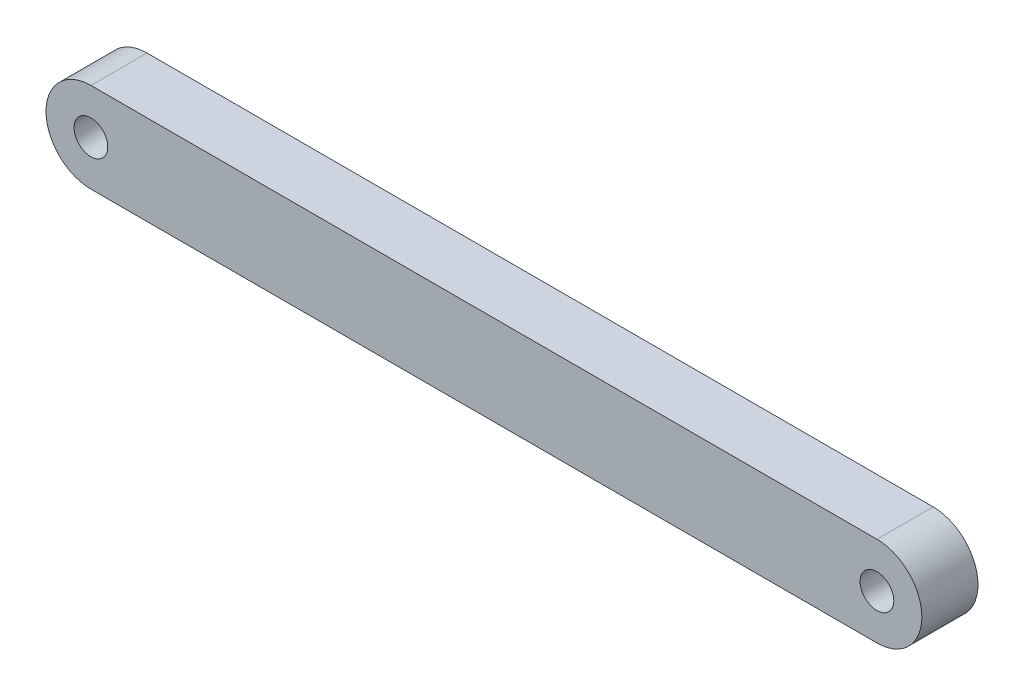
ISO-10303-21;
HEADER;
FILE_DESCRIPTION(('STEP AP214'),'2;1');
FILE_NAME('part.step','',(''),(''),'','','');
FILE_SCHEMA(('AUTOMOTIVE_DESIGN { 1 0 10303 214 1 1 1 1 }'));
ENDSEC;
DATA;
#1=APPLICATION_CONTEXT('core data for automotive mechanical design processes');
#2=APPLICATION_PROTOCOL_DEFINITION('international standard','automotive_design',2000,#1);
#3=PRODUCT_CONTEXT('',#1,'mechanical');
#4=PRODUCT('Part','Part','',(#3));
#5=PRODUCT_RELATED_PRODUCT_CATEGORY('part','',(#4));
#6=PRODUCT_DEFINITION_FORMATION('','',#4);
#7=PRODUCT_DEFINITION_CONTEXT('part definition',#1,'design');
#8=PRODUCT_DEFINITION('design','',#6,#7);
#9=PRODUCT_DEFINITION_SHAPE('','',#8);
#10=(LENGTH_UNIT() NAMED_UNIT(*) SI_UNIT(.MILLI.,.METRE.));
#11=(NAMED_UNIT(*) PLANE_ANGLE_UNIT() SI_UNIT($,.RADIAN.));
#12=(NAMED_UNIT(*) SI_UNIT($,.STERADIAN.) SOLID_ANGLE_UNIT());
#13=UNCERTAINTY_MEASURE_WITH_UNIT(LENGTH_MEASURE(1.E-05),#10,'distance_accuracy_value','');
#14=(GEOMETRIC_REPRESENTATION_CONTEXT(3) GLOBAL_UNCERTAINTY_ASSIGNED_CONTEXT((#13)) GLOBAL_UNIT_ASSIGNED_CONTEXT((#10,
#11,#12)) REPRESENTATION_CONTEXT('',''));
#15=CARTESIAN_POINT('',(0.,0.,0.));
#16=DIRECTION('',(0.,0.,1.));
#17=DIRECTION('',(1.,0.,0.));
#18=AXIS2_PLACEMENT_3D('',#15,#16,#17);
#19=CARTESIAN_POINT('',(0.,0.,5.));
#20=DIRECTION('',(0.,0.,1.));
#21=DIRECTION('',(1.,0.,0.));
#22=AXIS2_PLACEMENT_3D('',#19,#20,#21);
#23=PLANE('',#22);
#24=CARTESIAN_POINT('',(0.,0.,5.));
#25=DIRECTION('',(0.,0.,1.));
#26=DIRECTION('',(1.,0.,0.));
#27=AXIS2_PLACEMENT_3D('',#24,#25,#26);
#28=CIRCLE('',#27,1.5);
#29=CARTESIAN_POINT('',(1.5,0.,5.));
#30=VERTEX_POINT('',#29);
#31=EDGE_CURVE('E112',#30,#30,#28,.T.);
#32=ORIENTED_EDGE('',*,*,#31,.F.);
#33=EDGE_LOOP('',(#32));
#34=FACE_BOUND('',#33,.T.);
#35=CARTESIAN_POINT('',(0.,0.,5.));
#36=DIRECTION('',(0.,0.,1.));
#37=DIRECTION('',(1.,0.,0.));
#38=AXIS2_PLACEMENT_3D('',#35,#36,#37);
#39=CIRCLE('',#38,4.);
#40=CARTESIAN_POINT('',(0.,4.,5.));
#41=VERTEX_POINT('',#40);
#42=CARTESIAN_POINT('',(0.,-4.,5.));
#43=VERTEX_POINT('',#42);
#44=EDGE_CURVE('E92',#41,#43,#39,.T.);
#45=ORIENTED_EDGE('',*,*,#44,.T.);
#46=DIRECTION('',(1.,0.,0.));
#47=VECTOR('',#46,1.);
#48=CARTESIAN_POINT('',(0.,-4.,5.));
#49=LINE('',#48,#47);
#50=CARTESIAN_POINT('',(70.,-4.,5.));
#51=VERTEX_POINT('',#50);
#52=EDGE_CURVE('E87',#43,#51,#49,.T.);
#53=ORIENTED_EDGE('',*,*,#52,.T.);
#54=CARTESIAN_POINT('',(70.,0.,5.));
#55=DIRECTION('',(0.,0.,1.));
#56=DIRECTION('',(1.,0.,0.));
#57=AXIS2_PLACEMENT_3D('',#54,#55,#56);
#58=CIRCLE('',#57,4.);
#59=CARTESIAN_POINT('',(70.,4.,5.));
#60=VERTEX_POINT('',#59);
#61=EDGE_CURVE('E90',#51,#60,#58,.T.);
#62=ORIENTED_EDGE('',*,*,#61,.T.);
#63=DIRECTION('',(-1.,0.,0.));
#64=VECTOR('',#63,1.);
#65=CARTESIAN_POINT('',(0.,4.,5.));
#66=LINE('',#65,#64);
#67=EDGE_CURVE('E57',#60,#41,#66,.T.);
#68=ORIENTED_EDGE('',*,*,#67,.T.);
#69=EDGE_LOOP('',(#45,#53,#62,#68));
#70=FACE_BOUND('',#69,.T.);
#71=CARTESIAN_POINT('',(70.,0.,5.));
#72=DIRECTION('',(0.,0.,1.));
#73=DIRECTION('',(1.,0.,0.));
#74=AXIS2_PLACEMENT_3D('',#71,#72,#73);
#75=CIRCLE('',#74,1.5);
#76=CARTESIAN_POINT('',(71.5,0.,5.));
#77=VERTEX_POINT('',#76);
#78=EDGE_CURVE('E134',#77,#77,#75,.T.);
#79=ORIENTED_EDGE('',*,*,#78,.F.);
#80=EDGE_LOOP('',(#79));
#81=FACE_BOUND('',#80,.T.);
#82=ADVANCED_FACE('F39',(#34,#70,#81),#23,.T.);
#83=CARTESIAN_POINT('',(0.,0.,0.));
#84=DIRECTION('',(0.,0.,1.));
#85=DIRECTION('',(1.,0.,0.));
#86=AXIS2_PLACEMENT_3D('',#83,#84,#85);
#87=PLANE('',#86);
#88=CARTESIAN_POINT('',(0.,0.,0.));
#89=DIRECTION('',(0.,0.,1.));
#90=DIRECTION('',(1.,0.,0.));
#91=AXIS2_PLACEMENT_3D('',#88,#89,#90);
#92=CIRCLE('',#91,4.);
#93=CARTESIAN_POINT('',(0.,4.,0.));
#94=VERTEX_POINT('',#93);
#95=CARTESIAN_POINT('',(0.,-4.,0.));
#96=VERTEX_POINT('',#95);
#97=EDGE_CURVE('E108',#94,#96,#92,.T.);
#98=ORIENTED_EDGE('',*,*,#97,.F.);
#99=DIRECTION('',(-1.,0.,0.));
#100=VECTOR('',#99,1.);
#101=CARTESIAN_POINT('',(0.,4.,0.));
#102=LINE('',#101,#100);
#103=CARTESIAN_POINT('',(70.,4.,0.));
#104=VERTEX_POINT('',#103);
#105=EDGE_CURVE('E80',#104,#94,#102,.T.);
#106=ORIENTED_EDGE('',*,*,#105,.F.);
#107=CARTESIAN_POINT('',(70.,0.,0.));
#108=DIRECTION('',(0.,0.,1.));
#109=DIRECTION('',(1.,0.,0.));
#110=AXIS2_PLACEMENT_3D('',#107,#108,#109);
#111=CIRCLE('',#110,4.);
#112=CARTESIAN_POINT('',(70.,-4.,0.));
#113=VERTEX_POINT('',#112);
#114=EDGE_CURVE('E74',#113,#104,#111,.T.);
#115=ORIENTED_EDGE('',*,*,#114,.F.);
#116=DIRECTION('',(1.,0.,0.));
#117=VECTOR('',#116,1.);
#118=CARTESIAN_POINT('',(0.,-4.,0.));
#119=LINE('',#118,#117);
#120=EDGE_CURVE('E97',#96,#113,#119,.T.);
#121=ORIENTED_EDGE('',*,*,#120,.F.);
#122=EDGE_LOOP('',(#98,#106,#115,#121));
#123=FACE_BOUND('',#122,.T.);
#124=CARTESIAN_POINT('',(0.,0.,0.));
#125=DIRECTION('',(0.,0.,1.));
#126=DIRECTION('',(1.,0.,0.));
#127=AXIS2_PLACEMENT_3D('',#124,#125,#126);
#128=CIRCLE('',#127,1.5);
#129=CARTESIAN_POINT('',(1.5,0.,0.));
#130=VERTEX_POINT('',#129);
#131=EDGE_CURVE('E130',#130,#130,#128,.T.);
#132=ORIENTED_EDGE('',*,*,#131,.T.);
#133=EDGE_LOOP('',(#132));
#134=FACE_BOUND('',#133,.T.);
#135=CARTESIAN_POINT('',(70.,0.,0.));
#136=DIRECTION('',(0.,0.,1.));
#137=DIRECTION('',(1.,0.,0.));
#138=AXIS2_PLACEMENT_3D('',#135,#136,#137);
#139=CIRCLE('',#138,1.5);
#140=CARTESIAN_POINT('',(71.5,0.,0.));
#141=VERTEX_POINT('',#140);
#142=EDGE_CURVE('E138',#141,#141,#139,.T.);
#143=ORIENTED_EDGE('',*,*,#142,.T.);
#144=EDGE_LOOP('',(#143));
#145=FACE_BOUND('',#144,.T.);
#146=ADVANCED_FACE('F125',(#123,#134,#145),#87,.F.);
#147=CARTESIAN_POINT('',(0.,0.,5.));
#148=DIRECTION('',(0.,0.,-1.));
#149=DIRECTION('',(-1.,0.,0.));
#150=AXIS2_PLACEMENT_3D('',#147,#148,#149);
#151=CYLINDRICAL_SURFACE('',#150,4.);
#152=ORIENTED_EDGE('',*,*,#97,.T.);
#153=DIRECTION('',(0.,0.,-1.));
#154=VECTOR('',#153,1.);
#155=CARTESIAN_POINT('',(0.,-4.,5.));
#156=LINE('',#155,#154);
#157=EDGE_CURVE('E11',#43,#96,#156,.T.);
#158=ORIENTED_EDGE('',*,*,#157,.F.);
#159=ORIENTED_EDGE('',*,*,#44,.F.);
#160=DIRECTION('',(0.,0.,-1.));
#161=VECTOR('',#160,1.);
#162=CARTESIAN_POINT('',(0.,4.,5.));
#163=LINE('',#162,#161);
#164=EDGE_CURVE('E104',#41,#94,#163,.T.);
#165=ORIENTED_EDGE('',*,*,#164,.T.);
#166=EDGE_LOOP('',(#152,#158,#159,#165));
#167=FACE_BOUND('',#166,.T.);
#168=ADVANCED_FACE('F41',(#167),#151,.T.);
#169=CARTESIAN_POINT('',(0.,-4.,5.));
#170=DIRECTION('',(0.,1.,0.));
#171=DIRECTION('',(0.,0.,1.));
#172=AXIS2_PLACEMENT_3D('',#169,#170,#171);
#173=PLANE('',#172);
#174=ORIENTED_EDGE('',*,*,#120,.T.);
#175=DIRECTION('',(0.,0.,-1.));
#176=VECTOR('',#175,1.);
#177=CARTESIAN_POINT('',(70.,-4.,5.));
#178=LINE('',#177,#176);
#179=EDGE_CURVE('E49',#51,#113,#178,.T.);
#180=ORIENTED_EDGE('',*,*,#179,.F.);
#181=ORIENTED_EDGE('',*,*,#52,.F.);
#182=ORIENTED_EDGE('',*,*,#157,.T.);
#183=EDGE_LOOP('',(#174,#180,#181,#182));
#184=FACE_BOUND('',#183,.T.);
#185=ADVANCED_FACE('F96',(#184),#173,.F.);
#186=CARTESIAN_POINT('',(70.,0.,5.));
#187=DIRECTION('',(0.,0.,-1.));
#188=DIRECTION('',(-1.,0.,0.));
#189=AXIS2_PLACEMENT_3D('',#186,#187,#188);
#190=CYLINDRICAL_SURFACE('',#189,4.);
#191=ORIENTED_EDGE('',*,*,#114,.T.);
#192=DIRECTION('',(0.,0.,-1.));
#193=VECTOR('',#192,1.);
#194=CARTESIAN_POINT('',(70.,4.,5.));
#195=LINE('',#194,#193);
#196=EDGE_CURVE('E99',#60,#104,#195,.T.);
#197=ORIENTED_EDGE('',*,*,#196,.F.);
#198=ORIENTED_EDGE('',*,*,#61,.F.);
#199=ORIENTED_EDGE('',*,*,#179,.T.);
#200=EDGE_LOOP('',(#191,#197,#198,#199));
#201=FACE_BOUND('',#200,.T.);
#202=ADVANCED_FACE('F100',(#201),#190,.T.);
#203=CARTESIAN_POINT('',(0.,4.,5.));
#204=DIRECTION('',(0.,-1.,0.));
#205=DIRECTION('',(0.,0.,-1.));
#206=AXIS2_PLACEMENT_3D('',#203,#204,#205);
#207=PLANE('',#206);
#208=ORIENTED_EDGE('',*,*,#105,.T.);
#209=ORIENTED_EDGE('',*,*,#164,.F.);
#210=ORIENTED_EDGE('',*,*,#67,.F.);
#211=ORIENTED_EDGE('',*,*,#196,.T.);
#212=EDGE_LOOP('',(#208,#209,#210,#211));
#213=FACE_BOUND('',#212,.T.);
#214=ADVANCED_FACE('F122',(#213),#207,.F.);
#215=CARTESIAN_POINT('',(0.,0.,5.));
#216=DIRECTION('',(0.,0.,-1.));
#217=DIRECTION('',(-1.,0.,0.));
#218=AXIS2_PLACEMENT_3D('',#215,#216,#217);
#219=CYLINDRICAL_SURFACE('',#218,1.5);
#220=ORIENTED_EDGE('',*,*,#31,.T.);
#221=EDGE_LOOP('',(#220));
#222=FACE_BOUND('',#221,.T.);
#223=ORIENTED_EDGE('',*,*,#131,.F.);
#224=EDGE_LOOP('',(#223));
#225=FACE_BOUND('',#224,.T.);
#226=ADVANCED_FACE('F157',(#222,#225),#219,.F.);
#227=CARTESIAN_POINT('',(70.,0.,5.));
#228=DIRECTION('',(0.,0.,-1.));
#229=DIRECTION('',(-1.,0.,0.));
#230=AXIS2_PLACEMENT_3D('',#227,#228,#229);
#231=CYLINDRICAL_SURFACE('',#230,1.5);
#232=ORIENTED_EDGE('',*,*,#78,.T.);
#233=EDGE_LOOP('',(#232));
#234=FACE_BOUND('',#233,.T.);
#235=ORIENTED_EDGE('',*,*,#142,.F.);
#236=EDGE_LOOP('',(#235));
#237=FACE_BOUND('',#236,.T.);
#238=ADVANCED_FACE('F146',(#234,#237),#231,.F.);
#239=CLOSED_SHELL('',(#82,#146,#168,#185,#202,#214,#226,#238));
#240=MANIFOLD_SOLID_BREP('B2',#239);
#241=ADVANCED_BREP_SHAPE_REPRESENTATION('',(#18,#240),#14);
#242=SHAPE_DEFINITION_REPRESENTATION(#9,#241);
ENDSEC;
END-ISO-10303-21;
